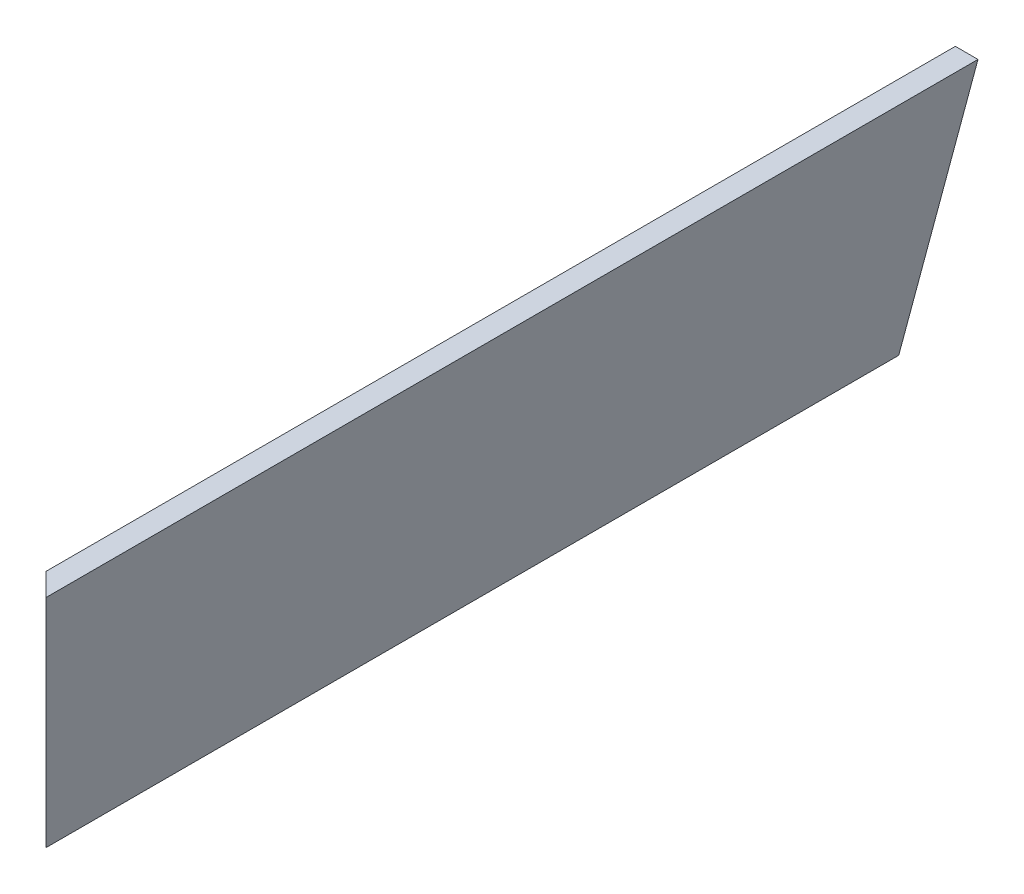
ISO-10303-21;
HEADER;
FILE_DESCRIPTION(('STEP AP214'),'2;1');
FILE_NAME('part.step','',(''),(''),'','','');
FILE_SCHEMA(('AUTOMOTIVE_DESIGN { 1 0 10303 214 1 1 1 1 }'));
ENDSEC;
DATA;
#1=APPLICATION_CONTEXT('core data for automotive mechanical design processes');
#2=APPLICATION_PROTOCOL_DEFINITION('international standard','automotive_design',2000,#1);
#3=PRODUCT_CONTEXT('',#1,'mechanical');
#4=PRODUCT('Part','Part','',(#3));
#5=PRODUCT_RELATED_PRODUCT_CATEGORY('part','',(#4));
#6=PRODUCT_DEFINITION_FORMATION('','',#4);
#7=PRODUCT_DEFINITION_CONTEXT('part definition',#1,'design');
#8=PRODUCT_DEFINITION('design','',#6,#7);
#9=PRODUCT_DEFINITION_SHAPE('','',#8);
#10=(LENGTH_UNIT() NAMED_UNIT(*) SI_UNIT(.MILLI.,.METRE.));
#11=(NAMED_UNIT(*) PLANE_ANGLE_UNIT() SI_UNIT($,.RADIAN.));
#12=(NAMED_UNIT(*) SI_UNIT($,.STERADIAN.) SOLID_ANGLE_UNIT());
#13=UNCERTAINTY_MEASURE_WITH_UNIT(LENGTH_MEASURE(1.E-05),#10,'distance_accuracy_value','');
#14=(GEOMETRIC_REPRESENTATION_CONTEXT(3) GLOBAL_UNCERTAINTY_ASSIGNED_CONTEXT((#13)) GLOBAL_UNIT_ASSIGNED_CONTEXT((#10,
#11,#12)) REPRESENTATION_CONTEXT('',''));
#15=CARTESIAN_POINT('',(0.,0.,0.));
#16=DIRECTION('',(0.,0.,1.));
#17=DIRECTION('',(1.,0.,0.));
#18=AXIS2_PLACEMENT_3D('',#15,#16,#17);
#19=CARTESIAN_POINT('',(527.712818728019,171.741611914197,730.545693715292));
#20=DIRECTION('',(0.96592582628907,-0.258819045102514,0.));
#21=DIRECTION('',(0.258819045102514,0.96592582628907,0.));
#22=AXIS2_PLACEMENT_3D('',#19,#20,#21);
#23=PLANE('',#22);
#24=DIRECTION('',(-0.250562807085726,-0.935113126531033,-0.250562807085726));
#25=VECTOR('',#24,1.);
#26=CARTESIAN_POINT('',(540.447015552035,219.26628145501,540.447015552035));
#27=LINE('',#26,#25);
#28=CARTESIAN_POINT('',(527.712818728019,171.741611914197,527.712818728019));
#29=VERTEX_POINT('',#28);
#30=CARTESIAN_POINT('',(481.694792508792,0.,481.694792508792));
#31=VERTEX_POINT('',#30);
#32=EDGE_CURVE('E90',#29,#31,#27,.T.);
#33=ORIENTED_EDGE('',*,*,#32,.F.);
#34=DIRECTION('',(0.,0.,-1.));
#35=VECTOR('',#34,1.);
#36=CARTESIAN_POINT('',(527.712818728019,171.741611914197,730.545693715292));
#37=LINE('',#36,#35);
#38=CARTESIAN_POINT('',(527.712818728019,171.741611914197,0.));
#39=VERTEX_POINT('',#38);
#40=EDGE_CURVE('E43',#29,#39,#37,.T.);
#41=ORIENTED_EDGE('',*,*,#40,.T.);
#42=DIRECTION('',(-0.258819045102514,-0.96592582628907,0.));
#43=VECTOR('',#42,1.);
#44=CARTESIAN_POINT('',(527.712818728019,171.741611914197,0.));
#45=LINE('',#44,#43);
#46=CARTESIAN_POINT('',(481.694792508792,0.,0.));
#47=VERTEX_POINT('',#46);
#48=EDGE_CURVE('E88',#39,#47,#45,.T.);
#49=ORIENTED_EDGE('',*,*,#48,.T.);
#50=DIRECTION('',(0.,0.,-1.));
#51=VECTOR('',#50,1.);
#52=CARTESIAN_POINT('',(481.694792508792,0.,730.545693715292));
#53=LINE('',#52,#51);
#54=EDGE_CURVE('E79',#31,#47,#53,.T.);
#55=ORIENTED_EDGE('',*,*,#54,.F.);
#56=EDGE_LOOP('',(#33,#41,#49,#55));
#57=FACE_BOUND('',#56,.T.);
#58=ADVANCED_FACE('F39',(#57),#23,.F.);
#59=CARTESIAN_POINT('',(481.694792508792,0.,730.545693715292));
#60=DIRECTION('',(0.,1.,0.));
#61=DIRECTION('',(0.,0.,1.));
#62=AXIS2_PLACEMENT_3D('',#59,#60,#61);
#63=PLANE('',#62);
#64=DIRECTION('',(0.707106781186548,0.,0.707106781186547));
#65=VECTOR('',#64,1.);
#66=CARTESIAN_POINT('',(606.120243112042,0.,606.120243112042));
#67=LINE('',#66,#65);
#68=CARTESIAN_POINT('',(494.8428,0.,494.8428));
#69=VERTEX_POINT('',#68);
#70=EDGE_CURVE('E49',#31,#69,#67,.T.);
#71=ORIENTED_EDGE('',*,*,#70,.F.);
#72=ORIENTED_EDGE('',*,*,#54,.T.);
#73=DIRECTION('',(1.,0.,0.));
#74=VECTOR('',#73,1.);
#75=CARTESIAN_POINT('',(481.694792508792,0.,0.));
#76=LINE('',#75,#74);
#77=CARTESIAN_POINT('',(494.8428,0.,0.));
#78=VERTEX_POINT('',#77);
#79=EDGE_CURVE('E102',#47,#78,#76,.T.);
#80=ORIENTED_EDGE('',*,*,#79,.T.);
#81=DIRECTION('',(0.,0.,-1.));
#82=VECTOR('',#81,1.);
#83=CARTESIAN_POINT('',(494.8428,0.,730.545693715292));
#84=LINE('',#83,#82);
#85=EDGE_CURVE('E116',#69,#78,#84,.T.);
#86=ORIENTED_EDGE('',*,*,#85,.F.);
#87=EDGE_LOOP('',(#71,#72,#80,#86));
#88=FACE_BOUND('',#87,.T.);
#89=ADVANCED_FACE('F123',(#88),#63,.F.);
#90=CARTESIAN_POINT('',(494.8428,0.,730.545693715292));
#91=DIRECTION('',(-0.96592582628907,0.258819045102514,0.));
#92=DIRECTION('',(-0.258819045102514,-0.96592582628907,0.));
#93=AXIS2_PLACEMENT_3D('',#90,#91,#92);
#94=PLANE('',#93);
#95=DIRECTION('',(0.250562807085725,0.935113126531033,0.250562807085725));
#96=VECTOR('',#95,1.);
#97=CARTESIAN_POINT('',(509.64063314588,55.2262651423517,509.64063314588));
#98=LINE('',#97,#96);
#99=CARTESIAN_POINT('',(540.860826219227,171.741611914197,540.860826219227));
#100=VERTEX_POINT('',#99);
#101=EDGE_CURVE('E11',#69,#100,#98,.T.);
#102=ORIENTED_EDGE('',*,*,#101,.F.);
#103=ORIENTED_EDGE('',*,*,#85,.T.);
#104=DIRECTION('',(0.258819045102514,0.96592582628907,0.));
#105=VECTOR('',#104,1.);
#106=CARTESIAN_POINT('',(494.8428,0.,0.));
#107=LINE('',#106,#105);
#108=CARTESIAN_POINT('',(540.860826219227,171.741611914197,0.));
#109=VERTEX_POINT('',#108);
#110=EDGE_CURVE('E118',#78,#109,#107,.T.);
#111=ORIENTED_EDGE('',*,*,#110,.T.);
#112=DIRECTION('',(0.,0.,-1.));
#113=VECTOR('',#112,1.);
#114=CARTESIAN_POINT('',(540.860826219227,171.741611914197,730.545693715292));
#115=LINE('',#114,#113);
#116=EDGE_CURVE('E62',#100,#109,#115,.T.);
#117=ORIENTED_EDGE('',*,*,#116,.F.);
#118=EDGE_LOOP('',(#102,#103,#111,#117));
#119=FACE_BOUND('',#118,.T.);
#120=ADVANCED_FACE('F122',(#119),#94,.F.);
#121=CARTESIAN_POINT('',(540.860826219227,171.741611914197,730.545693715292));
#122=DIRECTION('',(0.,-1.,0.));
#123=DIRECTION('',(0.,0.,-1.));
#124=AXIS2_PLACEMENT_3D('',#121,#122,#123);
#125=PLANE('',#124);
#126=DIRECTION('',(-0.707106781186548,0.,-0.707106781186547));
#127=VECTOR('',#126,1.);
#128=CARTESIAN_POINT('',(635.70325996726,171.741611914197,635.703259967259));
#129=LINE('',#128,#127);
#130=EDGE_CURVE('E99',#100,#29,#129,.T.);
#131=ORIENTED_EDGE('',*,*,#130,.F.);
#132=ORIENTED_EDGE('',*,*,#116,.T.);
#133=DIRECTION('',(-1.,0.,0.));
#134=VECTOR('',#133,1.);
#135=CARTESIAN_POINT('',(540.860826219227,171.741611914197,0.));
#136=LINE('',#135,#134);
#137=EDGE_CURVE('E94',#109,#39,#136,.T.);
#138=ORIENTED_EDGE('',*,*,#137,.T.);
#139=ORIENTED_EDGE('',*,*,#40,.F.);
#140=EDGE_LOOP('',(#131,#132,#138,#139));
#141=FACE_BOUND('',#140,.T.);
#142=ADVANCED_FACE('F95',(#141),#125,.F.);
#143=CARTESIAN_POINT('',(0.,0.,0.));
#144=DIRECTION('',(0.,0.,1.));
#145=DIRECTION('',(1.,0.,0.));
#146=AXIS2_PLACEMENT_3D('',#143,#144,#145);
#147=PLANE('',#146);
#148=ORIENTED_EDGE('',*,*,#48,.F.);
#149=ORIENTED_EDGE('',*,*,#137,.F.);
#150=ORIENTED_EDGE('',*,*,#110,.F.);
#151=ORIENTED_EDGE('',*,*,#79,.F.);
#152=EDGE_LOOP('',(#148,#149,#150,#151));
#153=FACE_BOUND('',#152,.T.);
#154=ADVANCED_FACE('F101',(#153),#147,.F.);
#155=CARTESIAN_POINT('',(0.,0.,0.));
#156=DIRECTION('',(-0.707106781186547,0.,0.707106781186548));
#157=DIRECTION('',(0.707106781186548,0.,0.707106781186547));
#158=AXIS2_PLACEMENT_3D('',#155,#156,#157);
#159=PLANE('',#158);
#160=ORIENTED_EDGE('',*,*,#130,.T.);
#161=ORIENTED_EDGE('',*,*,#32,.T.);
#162=ORIENTED_EDGE('',*,*,#70,.T.);
#163=ORIENTED_EDGE('',*,*,#101,.T.);
#164=EDGE_LOOP('',(#160,#161,#162,#163));
#165=FACE_BOUND('',#164,.T.);
#166=ADVANCED_FACE('F41',(#165),#159,.T.);
#167=CLOSED_SHELL('',(#58,#89,#120,#142,#154,#166));
#168=MANIFOLD_SOLID_BREP('B2',#167);
#169=ADVANCED_BREP_SHAPE_REPRESENTATION('',(#18,#168),#14);
#170=SHAPE_DEFINITION_REPRESENTATION(#9,#169);
ENDSEC;
END-ISO-10303-21;
